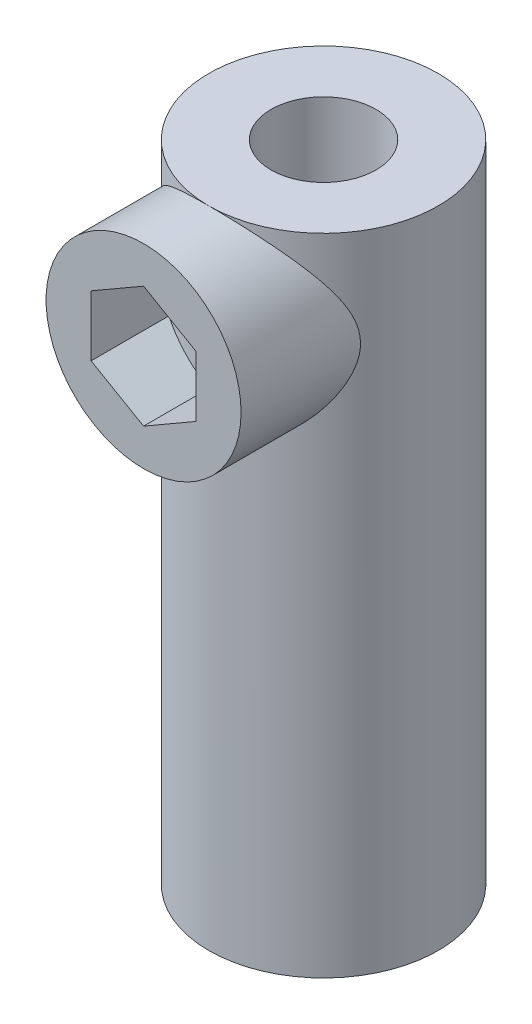
ISO-10303-21;
HEADER;
FILE_DESCRIPTION(('STEP AP214'),'2;1');
FILE_NAME('part.step','',(''),(''),'','','');
FILE_SCHEMA(('AUTOMOTIVE_DESIGN { 1 0 10303 214 1 1 1 1 }'));
ENDSEC;
DATA;
#1=APPLICATION_CONTEXT('core data for automotive mechanical design processes');
#2=APPLICATION_PROTOCOL_DEFINITION('international standard','automotive_design',2000,#1);
#3=PRODUCT_CONTEXT('',#1,'mechanical');
#4=PRODUCT('Part','Part','',(#3));
#5=PRODUCT_RELATED_PRODUCT_CATEGORY('part','',(#4));
#6=PRODUCT_DEFINITION_FORMATION('','',#4);
#7=PRODUCT_DEFINITION_CONTEXT('part definition',#1,'design');
#8=PRODUCT_DEFINITION('design','',#6,#7);
#9=PRODUCT_DEFINITION_SHAPE('','',#8);
#10=(LENGTH_UNIT() NAMED_UNIT(*) SI_UNIT(.MILLI.,.METRE.));
#11=(NAMED_UNIT(*) PLANE_ANGLE_UNIT() SI_UNIT($,.RADIAN.));
#12=(NAMED_UNIT(*) SI_UNIT($,.STERADIAN.) SOLID_ANGLE_UNIT());
#13=UNCERTAINTY_MEASURE_WITH_UNIT(LENGTH_MEASURE(1.E-05),#10,'distance_accuracy_value','');
#14=(GEOMETRIC_REPRESENTATION_CONTEXT(3) GLOBAL_UNCERTAINTY_ASSIGNED_CONTEXT((#13)) GLOBAL_UNIT_ASSIGNED_CONTEXT((#10,
#11,#12)) REPRESENTATION_CONTEXT('',''));
#15=CARTESIAN_POINT('',(0.,0.,0.));
#16=DIRECTION('',(0.,0.,1.));
#17=DIRECTION('',(1.,0.,0.));
#18=AXIS2_PLACEMENT_3D('',#15,#16,#17);
#19=CARTESIAN_POINT('',(0.,21.5,0.));
#20=DIRECTION('',(0.,1.,0.));
#21=DIRECTION('',(0.,0.,1.));
#22=AXIS2_PLACEMENT_3D('',#19,#20,#21);
#23=PLANE('',#22);
#24=CARTESIAN_POINT('',(0.,21.5,0.));
#25=DIRECTION('',(0.,1.,0.));
#26=DIRECTION('',(0.,0.,1.));
#27=AXIS2_PLACEMENT_3D('',#24,#25,#26);
#28=CIRCLE('',#27,7.65);
#29=CARTESIAN_POINT('',(0.,21.5,7.65));
#30=VERTEX_POINT('',#29);
#31=EDGE_CURVE('E12',#30,#30,#28,.T.);
#32=ORIENTED_EDGE('',*,*,#31,.T.);
#33=EDGE_LOOP('',(#32));
#34=FACE_BOUND('',#33,.T.);
#35=CARTESIAN_POINT('',(0.,21.5,0.));
#36=DIRECTION('',(0.,1.,0.));
#37=DIRECTION('',(0.,0.,1.));
#38=AXIS2_PLACEMENT_3D('',#35,#36,#37);
#39=CIRCLE('',#38,3.5);
#40=CARTESIAN_POINT('',(0.,21.5,3.5));
#41=VERTEX_POINT('',#40);
#42=EDGE_CURVE('E65',#41,#41,#39,.T.);
#43=ORIENTED_EDGE('',*,*,#42,.F.);
#44=EDGE_LOOP('',(#43));
#45=FACE_BOUND('',#44,.T.);
#46=ADVANCED_FACE('F57',(#34,#45),#23,.T.);
#47=CARTESIAN_POINT('',(0.,21.5,0.));
#48=DIRECTION('',(0.,-1.,0.));
#49=DIRECTION('',(0.,0.,-1.));
#50=AXIS2_PLACEMENT_3D('',#47,#48,#49);
#51=CYLINDRICAL_SURFACE('',#50,7.65);
#52=ORIENTED_EDGE('',*,*,#31,.F.);
#53=CARTESIAN_POINT('',(6.5,15.,4.03391869030599));
#54=CARTESIAN_POINT('',(6.49999880594593,15.1109920344448,4.03392206436329));
#55=CARTESIAN_POINT('',(6.49714842607336,15.2220209351757,4.03852481336712));
#56=CARTESIAN_POINT('',(6.48582565238759,15.4430986781032,4.05668266488845));
#57=CARTESIAN_POINT('',(6.47734937992992,15.5531467910348,4.07024394363137));
#58=CARTESIAN_POINT('',(6.4549713109572,15.7716481542604,4.10564020008858));
#59=CARTESIAN_POINT('',(6.44105436690729,15.8800960669002,4.12749827216898));
#60=CARTESIAN_POINT('',(6.40810839476618,16.0944966336692,4.17846442528634));
#61=CARTESIAN_POINT('',(6.38907723670139,16.2004482280857,4.20757552670421));
#62=CARTESIAN_POINT('',(6.33749525305287,16.4521444886909,4.2850445955481));
#63=CARTESIAN_POINT('',(6.30259661005797,16.5964828632677,4.33640887595706));
#64=CARTESIAN_POINT('',(6.22417163550574,16.8791577038976,4.44824122081794));
#65=CARTESIAN_POINT('',(6.18064052384551,17.0174907926485,4.5087143246664));
#66=CARTESIAN_POINT('',(6.08547050055896,17.2886119095082,4.63636743424818));
#67=CARTESIAN_POINT('',(6.03380970263124,17.4213837074085,4.70356536105675));
#68=CARTESIAN_POINT('',(5.92291703096014,17.6812318787089,4.84246448500782));
#69=CARTESIAN_POINT('',(5.86368563510034,17.8083086109191,4.91416539776036));
#70=CARTESIAN_POINT('',(5.70673092539118,18.1187697932968,5.09671478305162));
#71=CARTESIAN_POINT('',(5.60448368178362,18.298833076947,5.20934688579425));
#72=CARTESIAN_POINT('',(5.38406935724451,18.6475114366503,5.4368591122903));
#73=CARTESIAN_POINT('',(5.26589477975818,18.8161210652377,5.55174027271682));
#74=CARTESIAN_POINT('',(5.01385919921492,19.1416837946399,5.78036712807908));
#75=CARTESIAN_POINT('',(4.88001338648898,19.2986479463203,5.89411380847783));
#76=CARTESIAN_POINT('',(4.59652865814842,19.6005177952506,6.11776160228512));
#77=CARTESIAN_POINT('',(4.44689617047753,19.7454283577689,6.22766425680016));
#78=CARTESIAN_POINT('',(4.16635602558331,19.9918199877722,6.41763611238276));
#79=CARTESIAN_POINT('',(4.03853716438699,20.0958564832523,6.49896270773236));
#80=CARTESIAN_POINT('',(3.77331768369751,20.295241814654,6.65645153269014));
#81=CARTESIAN_POINT('',(3.63591932642952,20.3905926895243,6.73261497326889));
#82=CARTESIAN_POINT('',(3.35189092002638,20.5716382886225,6.87842863290172));
#83=CARTESIAN_POINT('',(3.20527253608082,20.657344846388,6.94808681562049));
#84=CARTESIAN_POINT('',(2.90305085087813,20.8182111491436,7.07968511745649));
#85=CARTESIAN_POINT('',(2.74744925921357,20.8933728916375,7.14162669807948));
#86=CARTESIAN_POINT('',(2.45644360679817,21.0196645914137,7.24622974345831));
#87=CARTESIAN_POINT('',(2.32238757403971,21.0726897579703,7.29035947294177));
#88=CARTESIAN_POINT('',(2.04921615581091,21.1702298624856,7.37180547065597));
#89=CARTESIAN_POINT('',(1.91010182966605,21.2147465702363,7.40912315574537));
#90=CARTESIAN_POINT('',(1.62755370785333,21.2946496307215,7.47627214661486));
#91=CARTESIAN_POINT('',(1.4841214255801,21.3300391417712,7.50610604193828));
#92=CARTESIAN_POINT('',(1.19377656686709,21.3911582209785,7.55772024297477));
#93=CARTESIAN_POINT('',(1.04686395111595,21.4168876799679,7.57950045767305));
#94=CARTESIAN_POINT('',(0.749923015342948,21.4583426890837,7.61462857465721));
#95=CARTESIAN_POINT('',(0.599883390545243,21.4740212035118,7.62793682846652));
#96=CARTESIAN_POINT('',(0.298549608851825,21.4948961817444,7.64566190089655));
#97=CARTESIAN_POINT('',(0.147255449292107,21.5000926232845,7.6500787006314));
#98=CARTESIAN_POINT('',(-0.155311817016419,21.4999048803707,7.64991917829146));
#99=CARTESIAN_POINT('',(-0.306584924488764,21.4945213511511,7.64534341314036));
#100=CARTESIAN_POINT('',(-0.60785023790395,21.4732775497288,7.62730561489838));
#101=CARTESIAN_POINT('',(-0.757842495917712,21.4574177054978,7.61384394480887));
#102=CARTESIAN_POINT('',(-1.04431381865001,21.4170670269415,7.57965323143254));
#103=CARTESIAN_POINT('',(-1.18096967487004,21.3933040362449,7.55953763139131));
#104=CARTESIAN_POINT('',(-1.45134616019478,21.337403460329,7.5123206935032));
#105=CARTESIAN_POINT('',(-1.58506579096477,21.305263073123,7.48521701838863));
#106=CARTESIAN_POINT('',(-1.98059070554117,21.1969207914691,7.39410397269428));
#107=CARTESIAN_POINT('',(-2.23699083312017,21.1087646109854,7.32026420049315));
#108=CARTESIAN_POINT('',(-2.75013119443144,20.8966129717109,7.14414283111815));
#109=CARTESIAN_POINT('',(-3.00528428624884,20.7703288832248,7.04006941518486));
#110=CARTESIAN_POINT('',(-3.49071349234056,20.4903111050015,6.81243984896068));
#111=CARTESIAN_POINT('',(-3.72096987925761,20.3365559001936,6.68886843698736));
#112=CARTESIAN_POINT('',(-4.10058791742225,20.0474669500013,6.46093244697219));
#113=CARTESIAN_POINT('',(-4.25572530398664,19.9172340950829,6.35955973472687));
#114=CARTESIAN_POINT('',(-4.55135087458483,19.6449523278251,6.15145178254238));
#115=CARTESIAN_POINT('',(-4.69183848166534,19.5029029505105,6.04471633164721));
#116=CARTESIAN_POINT('',(-4.95846999661617,19.2075245091846,5.8280064579781));
#117=CARTESIAN_POINT('',(-5.08458180492155,19.0541714146301,5.71802545134806));
#118=CARTESIAN_POINT('',(-5.32212542557276,18.7368775919579,5.49760848788709));
#119=CARTESIAN_POINT('',(-5.43356196815208,18.5729403009274,5.38717268954241));
#120=CARTESIAN_POINT('',(-5.61775617028429,18.2732599471518,5.19392174872709));
#121=CARTESIAN_POINT('',(-5.69351902890342,18.1396892729234,5.11058843960901));
#122=CARTESIAN_POINT('',(-5.8361178611338,17.865930860576,4.94711871399189));
#123=CARTESIAN_POINT('',(-5.90295272420427,17.7257423021973,4.86698269606724));
#124=CARTESIAN_POINT('',(-6.02718102778423,17.4387430413213,4.71226094527958));
#125=CARTESIAN_POINT('',(-6.08459704872671,17.2919492844158,4.63766218006163));
#126=CARTESIAN_POINT('',(-6.18955181468858,16.9911885441309,4.49662869062074));
#127=CARTESIAN_POINT('',(-6.23709642761751,16.8372258892231,4.43018912593583));
#128=CARTESIAN_POINT('',(-6.33197781723695,16.4824090487558,4.29384175085593));
#129=CARTESIAN_POINT('',(-6.37632358202969,16.2794140583566,4.2271790617023));
#130=CARTESIAN_POINT('',(-6.42843242994652,15.9676558942498,4.1471405047364));
#131=CARTESIAN_POINT('',(-6.4433950901937,15.8625999347277,4.12379606473809));
#132=CARTESIAN_POINT('',(-6.46824661375492,15.6505122640737,4.08470614481104));
#133=CARTESIAN_POINT('',(-6.47813807989229,15.5434815957577,4.06895676691426));
#134=CARTESIAN_POINT('',(-6.49267942496226,15.3270896915143,4.04571472064999));
#135=CARTESIAN_POINT('',(-6.49727668366078,15.21771588262,4.03830495761726));
#136=CARTESIAN_POINT('',(-6.50092287240017,14.9986363788047,4.03243282353423));
#137=CARTESIAN_POINT('',(-6.49997206690647,14.8889306999526,4.03397002599947));
#138=CARTESIAN_POINT('',(-6.49254753293766,14.670122074708,4.04590834222984));
#139=CARTESIAN_POINT('',(-6.48606996920922,14.5610195998333,4.05631561130719));
#140=CARTESIAN_POINT('',(-6.46776243251989,14.3443452464627,4.08544256087898));
#141=CARTESIAN_POINT('',(-6.45592942415457,14.2367742717169,4.10416695531258));
#142=CARTESIAN_POINT('',(-6.42427944427686,14.0023477349408,4.15357171888214));
#143=CARTESIAN_POINT('',(-6.4033313855027,13.8759947978621,4.18590475560627));
#144=CARTESIAN_POINT('',(-6.35464305992029,13.6271896129384,4.25945420952066));
#145=CARTESIAN_POINT('',(-6.32689714968014,13.5047407020779,4.30067800420741));
#146=CARTESIAN_POINT('',(-6.26506066608151,13.2637583303593,4.39027121693087));
#147=CARTESIAN_POINT('',(-6.23095257547014,13.1452367702567,4.43866028569342));
#148=CARTESIAN_POINT('',(-6.15688795196014,12.912504096951,4.54083898071107));
#149=CARTESIAN_POINT('',(-6.11693286765406,12.7982919248874,4.5946272682762));
#150=CARTESIAN_POINT('',(-6.00401614571994,12.5018597578462,4.74210665104851));
#151=CARTESIAN_POINT('',(-5.92634877535979,12.323123448683,4.83921957799867));
#152=CARTESIAN_POINT('',(-5.75696947089943,11.9759928683752,5.03954931341251));
#153=CARTESIAN_POINT('',(-5.66524910394108,11.8076048925872,5.14276976386983));
#154=CARTESIAN_POINT('',(-5.46806062569114,11.4805090466486,5.35196293949988));
#155=CARTESIAN_POINT('',(-5.36257462577955,11.3218141737408,5.45793909971734));
#156=CARTESIAN_POINT('',(-5.13810425835426,11.0142610499114,5.66976250363845));
#157=CARTESIAN_POINT('',(-5.01912283403454,10.8654006653667,5.77560977038223));
#158=CARTESIAN_POINT('',(-4.76235974937839,10.5717340556492,5.98928060218708));
#159=CARTESIAN_POINT('',(-4.62400034629445,10.4273569830968,6.09700200505508));
#160=CARTESIAN_POINT('',(-4.33249250851092,10.1502635011377,6.30748249642632));
#161=CARTESIAN_POINT('',(-4.1793412560165,10.0175493227038,6.4102406338302));
#162=CARTESIAN_POINT('',(-3.85873659195709,9.7653422411547,6.6081811107188));
#163=CARTESIAN_POINT('',(-3.69132123092806,9.64581600131302,6.70338237315135));
#164=CARTESIAN_POINT('',(-3.34220051807833,9.42122594263303,6.88409612179609));
#165=CARTESIAN_POINT('',(-3.16050277923136,9.31615449996439,6.9696137111826));
#166=CARTESIAN_POINT('',(-2.84308154830063,9.15295510786452,7.10344994133551));
#167=CARTESIAN_POINT('',(-2.71093542275595,9.09047419763023,7.15499338360002));
#168=CARTESIAN_POINT('',(-2.44074263024306,8.97385601617805,7.25160972906593));
#169=CARTESIAN_POINT('',(-2.30269756163638,8.91971650288043,7.29668437078884));
#170=CARTESIAN_POINT('',(-2.02134276661352,8.82048434505497,7.3795779342381));
#171=CARTESIAN_POINT('',(-1.87803551837696,8.77538750499752,7.41740022048237));
#172=CARTESIAN_POINT('',(-1.58687430359225,8.69487187815499,7.4850962121786));
#173=CARTESIAN_POINT('',(-1.43902021344534,8.65945335471893,7.51496970134154));
#174=CARTESIAN_POINT('',(-1.13881006173787,8.59869466244425,7.56630318718154));
#175=CARTESIAN_POINT('',(-0.98643151437395,8.57341935995469,7.58770902077639));
#176=CARTESIAN_POINT('',(-0.679256285460866,8.53373440061767,7.62135025826956));
#177=CARTESIAN_POINT('',(-0.524459608852426,8.5193247215725,7.63358568090239));
#178=CARTESIAN_POINT('',(-0.213811465691639,8.50165544532272,7.64859203795745));
#179=CARTESIAN_POINT('',(-0.0579602805985562,8.49839298198529,7.65136540522973));
#180=CARTESIAN_POINT('',(0.253444297227133,8.50307687034979,7.64738572026388));
#181=CARTESIAN_POINT('',(0.408997709830555,8.51102244601567,7.64063332758209));
#182=CARTESIAN_POINT('',(0.703624167685331,8.53666920427617,7.61886505426041));
#183=CARTESIAN_POINT('',(0.842850035804685,8.5533642485636,7.60470162542553));
#184=CARTESIAN_POINT('',(1.11905010488053,8.5955288792327,7.56899099835182));
#185=CARTESIAN_POINT('',(1.25602354145916,8.62100138244866,7.54744134561218));
#186=CARTESIAN_POINT('',(1.52679814871642,8.68034107254459,7.49735521156584));
#187=CARTESIAN_POINT('',(1.66060007563338,8.71420623569832,7.46882041461068));
#188=CARTESIAN_POINT('',(1.92437819068201,8.78987719726003,7.40524866057372));
#189=CARTESIAN_POINT('',(2.05435291093468,8.83168599769344,7.37020924540974));
#190=CARTESIAN_POINT('',(2.44899712795801,8.97235127499649,7.25274297031769));
#191=CARTESIAN_POINT('',(2.70633623670193,9.08377978027282,7.16024045860175));
#192=CARTESIAN_POINT('',(3.19795402038539,9.33436558956235,6.95462251109653));
#193=CARTESIAN_POINT('',(3.43222696298682,9.47352976050835,6.84150197118824));
#194=CARTESIAN_POINT('',(3.81882160481222,9.73633070436521,6.63130592821667));
#195=CARTESIAN_POINT('',(3.97667233503544,9.85468100917231,6.53764253249543));
#196=CARTESIAN_POINT('',(4.27877349744841,10.1030277130126,6.34403492452483));
#197=CARTESIAN_POINT('',(4.42302316993484,10.2330247617986,6.24409036195241));
#198=CARTESIAN_POINT('',(4.69844481893354,10.5042098608611,6.03959077302246));
#199=CARTESIAN_POINT('',(4.82956088871055,10.6454415119465,5.93501856017163));
#200=CARTESIAN_POINT('',(5.07808203704409,10.9379907995374,5.7238240780029));
#201=CARTESIAN_POINT('',(5.19548963159488,11.0893065772128,5.6172021890706));
#202=CARTESIAN_POINT('',(5.41880696393431,11.4049141597429,5.40217694152123));
#203=CARTESIAN_POINT('',(5.52444478824379,11.5694027989991,5.29377984298842));
#204=CARTESIAN_POINT('',(5.72137979489928,11.9089847096171,5.08029503074103));
#205=CARTESIAN_POINT('',(5.81266861388655,12.0840840837115,4.9752092753689));
#206=CARTESIAN_POINT('',(5.97992465805256,12.4446505418315,4.77285434829495));
#207=CARTESIAN_POINT('',(6.05595855420705,12.6300677773935,4.67555233262382));
#208=CARTESIAN_POINT('',(6.19200478148856,13.0124795136901,4.49382028599753));
#209=CARTESIAN_POINT('',(6.25204141511349,13.2094558921702,4.40937081457016));
#210=CARTESIAN_POINT('',(6.35399651412186,13.6144124831391,4.26114284479617));
#211=CARTESIAN_POINT('',(6.39603292138782,13.822310721995,4.19723049372819));
#212=CARTESIAN_POINT('',(6.44388917461408,14.141033992921,4.12306304384576));
#213=CARTESIAN_POINT('',(6.45729938575781,14.2482545638711,4.10197291432659));
#214=CARTESIAN_POINT('',(6.47881090154284,14.4644806323762,4.06791390524695));
#215=CARTESIAN_POINT('',(6.48691592307626,14.5734848253001,4.05493934008891));
#216=CARTESIAN_POINT('',(6.49483629824181,14.7356294492139,4.04222967979317));
#217=CARTESIAN_POINT('',(6.49677086439516,14.7884263283081,4.03911804577798));
#218=CARTESIAN_POINT('',(6.4993531604053,14.8941459914203,4.03496148887312));
#219=CARTESIAN_POINT('',(6.50000056943465,14.9470688035372,4.03391708124557));
#220=CARTESIAN_POINT('',(6.5,15.,4.03391869030599));
#221=B_SPLINE_CURVE_WITH_KNOTS('',3,(#53,#54,#55,#56,#57,#58,#59,#60,#61,#62,#63,#64,#65,#66,
#67,#68,#69,#70,#71,#72,#73,#74,#75,#76,#77,#78,#79,#80,#81,#82,#83,#84,#85,#86,#87,#88,#89,#90,
#91,#92,#93,#94,#95,#96,#97,#98,#99,#100,#101,#102,#103,#104,#105,#106,#107,#108,#109,#110,#111,
#112,#113,#114,#115,#116,#117,#118,#119,#120,#121,#122,#123,#124,#125,#126,#127,#128,#129,#130,
#131,#132,#133,#134,#135,#136,#137,#138,#139,#140,#141,#142,#143,#144,#145,#146,#147,#148,#149,
#150,#151,#152,#153,#154,#155,#156,#157,#158,#159,#160,#161,#162,#163,#164,#165,#166,#167,#168,
#169,#170,#171,#172,#173,#174,#175,#176,#177,#178,#179,#180,#181,#182,#183,#184,#185,#186,#187,
#188,#189,#190,#191,#192,#193,#194,#195,#196,#197,#198,#199,#200,#201,#202,#203,#204,#205,#206,
#207,#208,#209,#210,#211,#212,#213,#214,#215,#216,#217,#218,#219,#220),.UNSPECIFIED.,.T.,.F.,(4,
2,2,2,2,2,2,2,2,2,2,2,2,2,2,2,2,2,2,2,2,2,2,2,2,2,2,2,2,2,2,2,2,2,2,2,2,2,2,2,2,2,2,2,2,2,2,2,2,
2,2,2,2,2,2,2,2,2,2,2,2,2,2,2,2,2,2,2,2,2,2,2,2,2,2,2,2,2,2,2,2,2,2,4),(0.,0.332911845765214,
0.666053448816027,1.00012924344893,1.33434439055966,1.80495324949592,2.27582343252953,
2.74798366485205,3.22011410741517,3.92633244990351,4.63288435822182,5.33875697981566,
6.04434328873043,6.5952102800792,7.14594762039564,7.69600166508286,8.24595137196878,
8.6978055590125,9.14956565612102,9.6011692187588,10.0527778848206,10.5064848199484,
10.9601927187698,11.4138725196319,11.8675337882011,12.2875290306479,12.7076649295144,
13.5472457649905,14.4534416343169,15.3603503622474,16.0390403724845,16.7177571015316,
17.3979608132667,18.0779447375748,18.6017518167043,19.125623990908,19.6482212921754,
20.1705070482949,20.8226548016606,21.1482832913981,21.4737444824575,21.8024133164253,
22.1310664835164,22.4599479027263,22.7890159620391,23.1846751689565,23.5806639634028,
23.9777595894722,24.3747570011468,25.0269825049283,25.6796009372779,26.3330760621732,
26.9864089448315,27.6670350590222,28.3477910867656,29.0267848317322,29.7054190736658,
30.1699837144056,30.6344232663899,31.0986468311667,31.5628830263064,32.0300424518128,
32.4972009229426,32.9642392708909,33.4312452830488,33.8535688734132,34.2760329415403,
34.6983952396462,35.1209174737389,36.0032052441335,36.8857117276527,37.5400740581685,
38.1944729172484,38.8515485401015,39.5085033759359,40.1783937426681,40.8486731205512,
41.5159560037786,42.1822193180942,42.8440477099658,43.1739703540896,43.5036616015455,
43.662384989741,43.8211479352184),.UNSPECIFIED.);
#222=EDGE_CURVE('E118',#30,#30,#221,.T.);
#223=ORIENTED_EDGE('',*,*,#222,.F.);
#224=EDGE_LOOP('',(#52,#223));
#225=FACE_BOUND('',#224,.T.);
#226=CARTESIAN_POINT('',(0.,-21.5,0.));
#227=DIRECTION('',(0.,1.,0.));
#228=DIRECTION('',(0.,0.,1.));
#229=AXIS2_PLACEMENT_3D('',#226,#227,#228);
#230=CIRCLE('',#229,7.65);
#231=CARTESIAN_POINT('',(0.,-21.5,7.65));
#232=VERTEX_POINT('',#231);
#233=EDGE_CURVE('E156',#232,#232,#230,.T.);
#234=ORIENTED_EDGE('',*,*,#233,.T.);
#235=EDGE_LOOP('',(#234));
#236=FACE_BOUND('',#235,.T.);
#237=ADVANCED_FACE('F59',(#225,#236),#51,.T.);
#238=CARTESIAN_POINT('',(0.,21.5,0.));
#239=DIRECTION('',(0.,-1.,0.));
#240=DIRECTION('',(0.,0.,-1.));
#241=AXIS2_PLACEMENT_3D('',#238,#239,#240);
#242=CYLINDRICAL_SURFACE('',#241,3.5);
#243=CARTESIAN_POINT('',(2.25,15.,2.6809513236909));
#244=CARTESIAN_POINT('',(2.24998993279656,15.1110278510981,2.68096794230369));
#245=CARTESIAN_POINT('',(2.24171080111607,15.2221418110205,2.68797562628284));
#246=CARTESIAN_POINT('',(2.20923372044863,15.4404991821665,2.71471747257956));
#247=CARTESIAN_POINT('',(2.18500551900026,15.5477348283372,2.73447581916208));
#248=CARTESIAN_POINT('',(2.12243449318278,15.7545559296924,2.78331005782398));
#249=CARTESIAN_POINT('',(2.08421758685385,15.854200336079,2.81230253633535));
#250=CARTESIAN_POINT('',(1.99512179454972,16.0455339130931,2.8761937684625));
#251=CARTESIAN_POINT('',(1.94424018628447,16.1372213676439,2.91109379139403));
#252=CARTESIAN_POINT('',(1.82279355712549,16.3244200508419,2.98886782180925));
#253=CARTESIAN_POINT('',(1.75045432357929,16.4186033254313,3.0321684531223));
#254=CARTESIAN_POINT('',(1.59176125293289,16.5946333162801,3.11840835651351));
#255=CARTESIAN_POINT('',(1.50539505343587,16.6764690263946,3.16134727436577));
#256=CARTESIAN_POINT('',(1.3074746383366,16.8360801127766,3.2486397721681));
#257=CARTESIAN_POINT('',(1.19410442216513,16.911933825449,3.29244743403364));
#258=CARTESIAN_POINT('',(0.952887059290315,17.0428642291422,3.37016674077314));
#259=CARTESIAN_POINT('',(0.825055135037433,17.0979625076338,3.40408865932495));
#260=CARTESIAN_POINT('',(0.572700118508682,17.1794798067673,3.4549565291279));
#261=CARTESIAN_POINT('',(0.449266135237107,17.2083222602879,3.47332223431809));
#262=CARTESIAN_POINT('',(0.26106150028913,17.2357079983162,3.49082401452886));
#263=CARTESIAN_POINT('',(0.197811650016832,17.2421901180905,3.49498339775228));
#264=CARTESIAN_POINT('',(0.0708620491218975,17.2497821039921,3.49985859075535));
#265=CARTESIAN_POINT('',(0.00716235602789695,17.2508926450417,3.50057483315489));
#266=CARTESIAN_POINT('',(-0.165568191684278,17.2465456524078,3.49777776510425));
#267=CARTESIAN_POINT('',(-0.274469874427636,17.2358284758202,3.49087691185325));
#268=CARTESIAN_POINT('',(-0.488485570650298,17.1990220282097,3.46742022137514));
#269=CARTESIAN_POINT('',(-0.593599299939493,17.1729316063508,3.45086366132603));
#270=CARTESIAN_POINT('',(-0.797514374385264,17.1066481329344,3.4095155369999));
#271=CARTESIAN_POINT('',(-0.896316029506293,17.0664557745051,3.38472437746719));
#272=CARTESIAN_POINT('',(-1.08581075230308,16.9734914314954,3.32878241324653));
#273=CARTESIAN_POINT('',(-1.17650213765581,16.920716845253,3.2976302934767));
#274=CARTESIAN_POINT('',(-1.35963805843268,16.7965630687174,3.22679537049769));
#275=CARTESIAN_POINT('',(-1.45082867226407,16.7236689521756,3.18653123612724));
#276=CARTESIAN_POINT('',(-1.62048254862862,16.5652590565266,3.10370305689108));
#277=CARTESIAN_POINT('',(-1.69892627690037,16.4797242818839,3.06113561287145));
#278=CARTESIAN_POINT('',(-1.85216127593062,16.2843396062235,2.97126930905273));
#279=CARTESIAN_POINT('',(-1.92487286981337,16.1727617539059,2.9241510543335));
#280=CARTESIAN_POINT('',(-2.05032728211498,15.9362152473532,2.8376007355141));
#281=CARTESIAN_POINT('',(-2.10310602558655,15.8112712098565,2.79815490622919));
#282=CARTESIAN_POINT('',(-2.17459264754253,15.586116144777,2.74273753666387));
#283=CARTESIAN_POINT('',(-2.19866894824572,15.4884701247727,2.7232971442787));
#284=CARTESIAN_POINT('',(-2.23358563071415,15.2894241104593,2.69473933554445));
#285=CARTESIAN_POINT('',(-2.24444614072375,15.1880300678831,2.68560622228873));
#286=CARTESIAN_POINT('',(-2.25226446658786,14.9839983959535,2.67905534721847));
#287=CARTESIAN_POINT('',(-2.24917944170268,14.8813579018803,2.68167368573533));
#288=CARTESIAN_POINT('',(-2.22922734825303,14.6783323772377,2.69827729926398));
#289=CARTESIAN_POINT('',(-2.21234874306908,14.5779493069636,2.71227208921492));
#290=CARTESIAN_POINT('',(-2.16651453733593,14.3849566591738,2.74900598607657));
#291=CARTESIAN_POINT('',(-2.1379269826748,14.2922055396829,2.77147708985218));
#292=CARTESIAN_POINT('',(-2.0698698076764,14.1126624345131,2.82266682944014));
#293=CARTESIAN_POINT('',(-2.03039658628929,14.0258724326989,2.8513875319963));
#294=CARTESIAN_POINT('',(-1.9328244593948,13.8426438859404,2.9186200084255));
#295=CARTESIAN_POINT('',(-1.87259211174995,13.7476422774685,2.95794786199254));
#296=CARTESIAN_POINT('',(-1.73909343121181,13.5680090916421,3.03836163358643));
#297=CARTESIAN_POINT('',(-1.66581151559641,13.4833901187049,3.07944960835945));
#298=CARTESIAN_POINT('',(-1.49241702530615,13.3109871239774,3.16761844530397));
#299=CARTESIAN_POINT('',(-1.38984870575326,13.2254964068915,3.21440739400657));
#300=CARTESIAN_POINT('',(-1.16921660965138,13.0729924393256,3.30104998048744));
#301=CARTESIAN_POINT('',(-1.05116972150859,13.0059592937029,3.34091106847026));
#302=CARTESIAN_POINT('',(-0.827053794223495,12.9046620404733,3.4024510445066));
#303=CARTESIAN_POINT('',(-0.723294442946526,12.8665282789409,3.42617086324433));
#304=CARTESIAN_POINT('',(-0.509731929508921,12.8056956172991,3.46437672125789));
#305=CARTESIAN_POINT('',(-0.399933736735498,12.782984225559,3.47887023295334));
#306=CARTESIAN_POINT('',(-0.176900565596905,12.7541397622241,3.49732230223902));
#307=CARTESIAN_POINT('',(-0.0636552296509966,12.748062957644,3.50124510337195));
#308=CARTESIAN_POINT('',(0.162310335776909,12.7530185978975,3.49805965995272));
#309=CARTESIAN_POINT('',(0.275030533888278,12.7640520520435,3.49095076465477));
#310=CARTESIAN_POINT('',(0.490433557665958,12.8015258228908,3.46707325987076));
#311=CARTESIAN_POINT('',(0.593330075105532,12.8271048629793,3.45084520306644));
#312=CARTESIAN_POINT('',(0.793100276286804,12.8917958758713,3.41048199247624));
#313=CARTESIAN_POINT('',(0.88997298724147,12.9309100278049,3.38634556548954));
#314=CARTESIAN_POINT('',(1.08287498679204,13.024596145791,3.32989763999537));
#315=CARTESIAN_POINT('',(1.17831102430336,13.0800980320532,3.29711324727645));
#316=CARTESIAN_POINT('',(1.35896650831368,13.2034220813364,3.22685967945501));
#317=CARTESIAN_POINT('',(1.44417800816336,13.2712537255581,3.18938690609357));
#318=CARTESIAN_POINT('',(1.61572260847502,13.429157375361,3.10642041927923));
#319=CARTESIAN_POINT('',(1.70021898080631,13.5210450734011,3.06057859011959));
#320=CARTESIAN_POINT('',(1.85326379245017,13.7180202695562,2.97040476096267));
#321=CARTESIAN_POINT('',(1.92180641723402,13.8231125588173,2.92607331645183));
#322=CARTESIAN_POINT('',(2.03325398122752,14.0303123593355,2.84952970082758));
#323=CARTESIAN_POINT('',(2.07836690781949,14.1309213290343,2.81648946329075));
#324=CARTESIAN_POINT('',(2.15380817755849,14.3397996394599,2.75923416036607));
#325=CARTESIAN_POINT('',(2.18417398653391,14.4480487591835,2.73499677084659));
#326=CARTESIAN_POINT('',(2.22073361962975,14.6308919548486,2.70530605301007));
#327=CARTESIAN_POINT('',(2.23166990230549,14.7039745185406,2.69624609230348));
#328=CARTESIAN_POINT('',(2.24630634998145,14.8513585456327,2.6840632566126));
#329=CARTESIAN_POINT('',(2.25000674061678,14.9256599709525,2.68094019649943));
#330=CARTESIAN_POINT('',(2.25,15.,2.6809513236909));
#331=B_SPLINE_CURVE_WITH_KNOTS('',3,(#243,#244,#245,#246,#247,#248,#249,#250,#251,#252,#253,
#254,#255,#256,#257,#258,#259,#260,#261,#262,#263,#264,#265,#266,#267,#268,#269,#270,#271,#272,
#273,#274,#275,#276,#277,#278,#279,#280,#281,#282,#283,#284,#285,#286,#287,#288,#289,#290,#291,
#292,#293,#294,#295,#296,#297,#298,#299,#300,#301,#302,#303,#304,#305,#306,#307,#308,#309,#310,
#311,#312,#313,#314,#315,#316,#317,#318,#319,#320,#321,#322,#323,#324,#325,#326,#327,#328,#329,
#330),.UNSPECIFIED.,.T.,.F.,(4,2,2,2,2,2,2,2,2,2,2,2,2,2,2,2,2,2,2,2,2,2,2,2,2,2,2,2,2,2,2,2,2,
2,2,2,2,2,2,2,2,2,2,4),(0.,0.332747405290111,0.666127797128148,0.996578267475526,
1.32709982990864,1.70488357037008,2.08300208827668,2.51043691367016,2.93742593377158,
3.31909089208858,3.50995890153378,3.7008029283838,4.02800058752422,4.35522274368344,
4.68242881870657,5.00970260980392,5.37875195797702,5.74836163684474,6.17015995527988,
6.59119439537438,6.89723644188507,7.20281178682076,7.5093264973106,7.81609783203559,
8.11388781485575,8.41177642696695,8.76797690724211,9.12460562052131,9.5469917124931,
9.9689207224482,10.3066632064346,10.6441318023679,10.9827404941252,11.3213691607396,
11.6417703868448,11.9622232210183,12.3063972236073,12.6508370136301,13.0481637048372,
13.4456349804135,13.7896644753437,14.132815312559,14.3556172754663,14.5784122906818),.UNSPECIFIED.);
#332=CARTESIAN_POINT('',(2.25,15.,2.6809513236909));
#333=VERTEX_POINT('',#332);
#334=EDGE_CURVE('E196',#333,#333,#331,.T.);
#335=ORIENTED_EDGE('',*,*,#334,.T.);
#336=EDGE_LOOP('',(#335));
#337=FACE_BOUND('',#336,.T.);
#338=ORIENTED_EDGE('',*,*,#42,.T.);
#339=EDGE_LOOP('',(#338));
#340=FACE_BOUND('',#339,.T.);
#341=CARTESIAN_POINT('',(0.,-21.5,0.));
#342=DIRECTION('',(0.,1.,0.));
#343=DIRECTION('',(0.,0.,1.));
#344=AXIS2_PLACEMENT_3D('',#341,#342,#343);
#345=CIRCLE('',#344,3.5);
#346=CARTESIAN_POINT('',(0.,-21.5,3.5));
#347=VERTEX_POINT('',#346);
#348=EDGE_CURVE('E153',#347,#347,#345,.T.);
#349=ORIENTED_EDGE('',*,*,#348,.F.);
#350=EDGE_LOOP('',(#349));
#351=FACE_BOUND('',#350,.T.);
#352=ADVANCED_FACE('F162',(#337,#340,#351),#242,.F.);
#353=CARTESIAN_POINT('',(0.,-21.5,0.));
#354=DIRECTION('',(0.,-1.,0.));
#355=DIRECTION('',(0.,0.,1.));
#356=AXIS2_PLACEMENT_3D('',#353,#354,#355);
#357=PLANE('',#356);
#358=ORIENTED_EDGE('',*,*,#233,.F.);
#359=EDGE_LOOP('',(#358));
#360=FACE_BOUND('',#359,.T.);
#361=ORIENTED_EDGE('',*,*,#348,.T.);
#362=EDGE_LOOP('',(#361));
#363=FACE_BOUND('',#362,.T.);
#364=ADVANCED_FACE('F174',(#360,#363),#357,.T.);
#365=CARTESIAN_POINT('',(-3.5,17.0207259421637,-500000.));
#366=DIRECTION('',(-1.,0.,0.));
#367=DIRECTION('',(0.,0.,1.));
#368=AXIS2_PLACEMENT_3D('',#365,#366,#367);
#369=PLANE('',#368);
#370=DIRECTION('',(0.,-1.,0.));
#371=VECTOR('',#370,1.);
#372=CARTESIAN_POINT('',(-3.5,21.5,6.80238928612587));
#373=LINE('',#372,#371);
#374=CARTESIAN_POINT('',(-3.50000000000125,17.020725942163,6.80238928612522));
#375=VERTEX_POINT('',#374);
#376=CARTESIAN_POINT('',(-3.50000000000125,12.979274057837,6.80238928612522));
#377=VERTEX_POINT('',#376);
#378=EDGE_CURVE('E114',#375,#377,#373,.T.);
#379=ORIENTED_EDGE('',*,*,#378,.F.);
#380=DIRECTION('',(0.,0.,1.));
#381=VECTOR('',#380,1.);
#382=CARTESIAN_POINT('',(-3.5,17.0207259421637,-500000.));
#383=LINE('',#382,#381);
#384=CARTESIAN_POINT('',(-3.5,17.0207259421637,12.));
#385=VERTEX_POINT('',#384);
#386=EDGE_CURVE('E145',#375,#385,#383,.T.);
#387=ORIENTED_EDGE('',*,*,#386,.T.);
#388=DIRECTION('',(0.,-1.,0.));
#389=VECTOR('',#388,1.);
#390=CARTESIAN_POINT('',(-3.5,17.0207259421637,12.));
#391=LINE('',#390,#389);
#392=CARTESIAN_POINT('',(-3.5,12.9792740578363,12.));
#393=VERTEX_POINT('',#392);
#394=EDGE_CURVE('E239',#385,#393,#391,.T.);
#395=ORIENTED_EDGE('',*,*,#394,.T.);
#396=DIRECTION('',(0.,0.,1.));
#397=VECTOR('',#396,1.);
#398=CARTESIAN_POINT('',(-3.5,12.9792740578363,-500000.));
#399=LINE('',#398,#397);
#400=EDGE_CURVE('E147',#377,#393,#399,.T.);
#401=ORIENTED_EDGE('',*,*,#400,.F.);
#402=EDGE_LOOP('',(#379,#387,#395,#401));
#403=FACE_BOUND('',#402,.T.);
#404=ADVANCED_FACE('F178',(#403),#369,.F.);
#405=CARTESIAN_POINT('',(0.,19.0414518843274,-500000.));
#406=DIRECTION('',(-0.500000000000001,0.866025403784438,0.));
#407=DIRECTION('',(-0.866025403784438,-0.500000000000001,0.));
#408=AXIS2_PLACEMENT_3D('',#405,#406,#407);
#409=PLANE('',#408);
#410=CARTESIAN_POINT('',(0.,19.0414518843274,0.));
#411=DIRECTION('',(-0.500000000000001,0.866025403784438,0.));
#412=DIRECTION('',(-0.866025403784438,-0.500000000000001,0.));
#413=AXIS2_PLACEMENT_3D('',#410,#411,#412);
#414=ELLIPSE('',#413,8.83345911860128,7.65);
#415=CARTESIAN_POINT('',(0.,19.0414518843274,7.65));
#416=VERTEX_POINT('',#415);
#417=EDGE_CURVE('E72',#416,#375,#414,.F.);
#418=ORIENTED_EDGE('',*,*,#417,.F.);
#419=DIRECTION('',(0.,0.,1.));
#420=VECTOR('',#419,1.);
#421=CARTESIAN_POINT('',(0.,19.0414518843274,-500000.));
#422=LINE('',#421,#420);
#423=CARTESIAN_POINT('',(0.,19.0414518843274,12.));
#424=VERTEX_POINT('',#423);
#425=EDGE_CURVE('E143',#416,#424,#422,.T.);
#426=ORIENTED_EDGE('',*,*,#425,.T.);
#427=DIRECTION('',(-0.866025403784438,-0.500000000000001,0.));
#428=VECTOR('',#427,1.);
#429=CARTESIAN_POINT('',(0.,19.0414518843274,12.));
#430=LINE('',#429,#428);
#431=EDGE_CURVE('E237',#424,#385,#430,.T.);
#432=ORIENTED_EDGE('',*,*,#431,.T.);
#433=ORIENTED_EDGE('',*,*,#386,.F.);
#434=EDGE_LOOP('',(#418,#426,#432,#433));
#435=FACE_BOUND('',#434,.T.);
#436=ADVANCED_FACE('F212',(#435),#409,.F.);
#437=CARTESIAN_POINT('',(3.5,17.0207259421637,-500000.));
#438=DIRECTION('',(0.5,0.866025403784439,0.));
#439=DIRECTION('',(-0.866025403784439,0.5,0.));
#440=AXIS2_PLACEMENT_3D('',#437,#438,#439);
#441=PLANE('',#440);
#442=CARTESIAN_POINT('',(0.,19.0414518843274,0.));
#443=DIRECTION('',(0.5,0.866025403784439,0.));
#444=DIRECTION('',(0.866025403784439,-0.5,0.));
#445=AXIS2_PLACEMENT_3D('',#442,#443,#444);
#446=ELLIPSE('',#445,8.83345911860127,7.65);
#447=CARTESIAN_POINT('',(3.5,17.0207259421637,6.80238928612587));
#448=VERTEX_POINT('',#447);
#449=EDGE_CURVE('E77',#448,#416,#446,.F.);
#450=ORIENTED_EDGE('',*,*,#449,.F.);
#451=DIRECTION('',(0.,0.,1.));
#452=VECTOR('',#451,1.);
#453=CARTESIAN_POINT('',(3.5,17.0207259421637,-500000.));
#454=LINE('',#453,#452);
#455=CARTESIAN_POINT('',(3.5,17.0207259421637,12.));
#456=VERTEX_POINT('',#455);
#457=EDGE_CURVE('E137',#448,#456,#454,.T.);
#458=ORIENTED_EDGE('',*,*,#457,.T.);
#459=DIRECTION('',(-0.866025403784439,0.5,0.));
#460=VECTOR('',#459,1.);
#461=CARTESIAN_POINT('',(3.5,17.0207259421637,12.));
#462=LINE('',#461,#460);
#463=EDGE_CURVE('E232',#456,#424,#462,.T.);
#464=ORIENTED_EDGE('',*,*,#463,.T.);
#465=ORIENTED_EDGE('',*,*,#425,.F.);
#466=EDGE_LOOP('',(#450,#458,#464,#465));
#467=FACE_BOUND('',#466,.T.);
#468=ADVANCED_FACE('F215',(#467),#441,.F.);
#469=CARTESIAN_POINT('',(3.5,12.9792740578363,-500000.));
#470=DIRECTION('',(1.,0.,0.));
#471=DIRECTION('',(0.,1.,0.));
#472=AXIS2_PLACEMENT_3D('',#469,#470,#471);
#473=PLANE('',#472);
#474=DIRECTION('',(0.,-1.,0.));
#475=VECTOR('',#474,1.);
#476=CARTESIAN_POINT('',(3.5,21.5,6.80238928612587));
#477=LINE('',#476,#475);
#478=CARTESIAN_POINT('',(3.50000000000126,12.979274057837,6.80238928612522));
#479=VERTEX_POINT('',#478);
#480=EDGE_CURVE('E127',#479,#448,#477,.F.);
#481=ORIENTED_EDGE('',*,*,#480,.F.);
#482=DIRECTION('',(0.,0.,1.));
#483=VECTOR('',#482,1.);
#484=CARTESIAN_POINT('',(3.5,12.9792740578363,-500000.));
#485=LINE('',#484,#483);
#486=CARTESIAN_POINT('',(3.5,12.9792740578363,12.));
#487=VERTEX_POINT('',#486);
#488=EDGE_CURVE('E126',#479,#487,#485,.T.);
#489=ORIENTED_EDGE('',*,*,#488,.T.);
#490=DIRECTION('',(0.,1.,0.));
#491=VECTOR('',#490,1.);
#492=CARTESIAN_POINT('',(3.5,12.9792740578363,12.));
#493=LINE('',#492,#491);
#494=EDGE_CURVE('E230',#487,#456,#493,.T.);
#495=ORIENTED_EDGE('',*,*,#494,.T.);
#496=ORIENTED_EDGE('',*,*,#457,.F.);
#497=EDGE_LOOP('',(#481,#489,#495,#496));
#498=FACE_BOUND('',#497,.T.);
#499=ADVANCED_FACE('F188',(#498),#473,.F.);
#500=CARTESIAN_POINT('',(0.,15.,12.));
#501=DIRECTION('',(0.,0.,1.));
#502=DIRECTION('',(1.,0.,0.));
#503=AXIS2_PLACEMENT_3D('',#500,#501,#502);
#504=PLANE('',#503);
#505=DIRECTION('',(0.866025403784439,-0.5,0.));
#506=VECTOR('',#505,1.);
#507=CARTESIAN_POINT('',(-3.5,12.9792740578363,12.));
#508=LINE('',#507,#506);
#509=CARTESIAN_POINT('',(0.,10.9585481156726,12.));
#510=VERTEX_POINT('',#509);
#511=EDGE_CURVE('E133',#393,#510,#508,.T.);
#512=ORIENTED_EDGE('',*,*,#511,.F.);
#513=ORIENTED_EDGE('',*,*,#394,.F.);
#514=ORIENTED_EDGE('',*,*,#431,.F.);
#515=ORIENTED_EDGE('',*,*,#463,.F.);
#516=ORIENTED_EDGE('',*,*,#494,.F.);
#517=DIRECTION('',(0.866025403784438,0.500000000000001,0.));
#518=VECTOR('',#517,1.);
#519=CARTESIAN_POINT('',(0.,10.9585481156726,12.));
#520=LINE('',#519,#518);
#521=EDGE_CURVE('E135',#510,#487,#520,.T.);
#522=ORIENTED_EDGE('',*,*,#521,.F.);
#523=EDGE_LOOP('',(#512,#513,#514,#515,#516,#522));
#524=FACE_BOUND('',#523,.T.);
#525=CARTESIAN_POINT('',(0.,15.,12.));
#526=DIRECTION('',(0.,0.,1.));
#527=DIRECTION('',(1.,0.,0.));
#528=AXIS2_PLACEMENT_3D('',#525,#526,#527);
#529=CIRCLE('',#528,6.5);
#530=CARTESIAN_POINT('',(6.5,15.,12.));
#531=VERTEX_POINT('',#530);
#532=EDGE_CURVE('E157',#531,#531,#529,.T.);
#533=ORIENTED_EDGE('',*,*,#532,.T.);
#534=EDGE_LOOP('',(#533));
#535=FACE_BOUND('',#534,.T.);
#536=ADVANCED_FACE('F186',(#524,#535),#504,.T.);
#537=CARTESIAN_POINT('',(0.,15.,-500000.));
#538=DIRECTION('',(0.,0.,1.));
#539=DIRECTION('',(1.,0.,0.));
#540=AXIS2_PLACEMENT_3D('',#537,#538,#539);
#541=CYLINDRICAL_SURFACE('',#540,6.5);
#542=ORIENTED_EDGE('',*,*,#532,.F.);
#543=EDGE_LOOP('',(#542));
#544=FACE_BOUND('',#543,.T.);
#545=ORIENTED_EDGE('',*,*,#222,.T.);
#546=EDGE_LOOP('',(#545));
#547=FACE_BOUND('',#546,.T.);
#548=ADVANCED_FACE('F182',(#544,#547),#541,.T.);
#549=CARTESIAN_POINT('',(-3.5,12.9792740578363,-500000.));
#550=DIRECTION('',(-0.5,-0.866025403784439,0.));
#551=DIRECTION('',(0.866025403784439,-0.5,0.));
#552=AXIS2_PLACEMENT_3D('',#549,#550,#551);
#553=PLANE('',#552);
#554=CARTESIAN_POINT('',(0.,10.9585481156726,0.));
#555=DIRECTION('',(-0.5,-0.866025403784439,0.));
#556=DIRECTION('',(0.866025403784439,-0.5,0.));
#557=AXIS2_PLACEMENT_3D('',#554,#555,#556);
#558=ELLIPSE('',#557,8.83345911860127,7.65);
#559=CARTESIAN_POINT('',(0.,10.9585481156726,7.65000000001237));
#560=VERTEX_POINT('',#559);
#561=EDGE_CURVE('E109',#377,#560,#558,.F.);
#562=ORIENTED_EDGE('',*,*,#561,.F.);
#563=ORIENTED_EDGE('',*,*,#400,.T.);
#564=ORIENTED_EDGE('',*,*,#511,.T.);
#565=DIRECTION('',(0.,0.,1.));
#566=VECTOR('',#565,1.);
#567=CARTESIAN_POINT('',(0.,10.9585481156726,-500000.));
#568=LINE('',#567,#566);
#569=EDGE_CURVE('E124',#560,#510,#568,.T.);
#570=ORIENTED_EDGE('',*,*,#569,.F.);
#571=EDGE_LOOP('',(#562,#563,#564,#570));
#572=FACE_BOUND('',#571,.T.);
#573=ADVANCED_FACE('F131',(#572),#553,.F.);
#574=CARTESIAN_POINT('',(0.,10.9585481156726,-500000.));
#575=DIRECTION('',(0.500000000000001,-0.866025403784438,0.));
#576=DIRECTION('',(0.866025403784438,0.500000000000001,0.));
#577=AXIS2_PLACEMENT_3D('',#574,#575,#576);
#578=PLANE('',#577);
#579=CARTESIAN_POINT('',(0.,10.9585481156726,0.));
#580=DIRECTION('',(0.500000000000001,-0.866025403784438,0.));
#581=DIRECTION('',(-0.866025403784438,-0.500000000000001,0.));
#582=AXIS2_PLACEMENT_3D('',#579,#580,#581);
#583=ELLIPSE('',#582,8.83345911860128,7.65);
#584=EDGE_CURVE('E112',#560,#479,#583,.F.);
#585=ORIENTED_EDGE('',*,*,#584,.F.);
#586=ORIENTED_EDGE('',*,*,#569,.T.);
#587=ORIENTED_EDGE('',*,*,#521,.T.);
#588=ORIENTED_EDGE('',*,*,#488,.F.);
#589=EDGE_LOOP('',(#585,#586,#587,#588));
#590=FACE_BOUND('',#589,.T.);
#591=ADVANCED_FACE('F122',(#590),#578,.F.);
#592=CARTESIAN_POINT('',(2.25,15.,7.31163456417237));
#593=CARTESIAN_POINT('',(2.24999816612699,15.1234135324483,7.31163604292304));
#594=CARTESIAN_POINT('',(2.23981151711231,15.2468453194984,7.31479341141021));
#595=CARTESIAN_POINT('',(2.19943383752148,15.4901083352382,7.32703368330924));
#596=CARTESIAN_POINT('',(2.16923552287948,15.6099382362654,7.33611874432918));
#597=CARTESIAN_POINT('',(2.08994207956667,15.8424412526139,7.35909837558813));
#598=CARTESIAN_POINT('',(2.0408774714664,15.9551255863164,7.37298517427465));
#599=CARTESIAN_POINT('',(1.92534371750499,16.1706894296607,7.40399318664189));
#600=CARTESIAN_POINT('',(1.85887218805424,16.2735675938764,7.42111484319333));
#601=CARTESIAN_POINT('',(1.70824718243852,16.4697279826024,7.4572473989209));
#602=CARTESIAN_POINT('',(1.62365708541413,16.5626678246496,7.47629734698482));
#603=CARTESIAN_POINT('',(1.44013246006963,16.7332681003319,7.51380584208572));
#604=CARTESIAN_POINT('',(1.34119616031283,16.8109266442716,7.53226431574461));
#605=CARTESIAN_POINT('',(1.1293632407703,16.950235701097,7.56695221827542));
#606=CARTESIAN_POINT('',(1.01622894694634,17.0115387209858,7.58313026183807));
#607=CARTESIAN_POINT('',(0.780701073328107,17.1141178941512,7.61098183843668));
#608=CARTESIAN_POINT('',(0.658309415180909,17.1553981906357,7.62265630327456));
#609=CARTESIAN_POINT('',(0.411321605254609,17.2156316776145,7.63990906654219));
#610=CARTESIAN_POINT('',(0.28687920649951,17.2351689250626,7.64564652874187));
#611=CARTESIAN_POINT('',(0.0363594548984678,17.2532068135047,7.65093860562492));
#612=CARTESIAN_POINT('',(-0.0897175622899628,17.251711707077,7.65049447017944));
#613=CARTESIAN_POINT('',(-0.335836208191782,17.2281229272735,7.64358666235583));
#614=CARTESIAN_POINT('',(-0.455944426860295,17.2066614549265,7.63730774539814));
#615=CARTESIAN_POINT('',(-0.690772358486197,17.1447797562877,7.61965920799479));
#616=CARTESIAN_POINT('',(-0.805491734993852,17.1043583479679,7.60828927015926));
#617=CARTESIAN_POINT('',(-1.02780865016154,17.0052659244536,7.58147740262546));
#618=CARTESIAN_POINT('',(-1.13531050191593,16.9463928486843,7.56599069087775));
#619=CARTESIAN_POINT('',(-1.33911378724876,16.8122271694349,7.53259283362212));
#620=CARTESIAN_POINT('',(-1.43541263906862,16.7369307926134,7.51468113131894));
#621=CARTESIAN_POINT('',(-1.61784997455011,16.5687624242907,7.47757019009463));
#622=CARTESIAN_POINT('',(-1.70347877940172,16.4753418897946,7.45834783785073));
#623=CARTESIAN_POINT('',(-1.85799504023831,16.2752769918736,7.42136668349325));
#624=CARTESIAN_POINT('',(-1.92688096403929,16.1686314195392,7.40360801542336));
#625=CARTESIAN_POINT('',(-2.04646020602181,15.9438460623763,7.37145748553168));
#626=CARTESIAN_POINT('',(-2.09698612567037,15.8256124126713,7.35709700023896));
#627=CARTESIAN_POINT('',(-2.17726267867351,15.5817955473458,7.33374358846953));
#628=CARTESIAN_POINT('',(-2.20701978114172,15.4562146334876,7.32474899074211));
#629=CARTESIAN_POINT('',(-2.24397513911459,15.2061036070592,7.31351062324817));
#630=CARTESIAN_POINT('',(-2.25194551010404,15.0816978564272,7.31103591048747));
#631=CARTESIAN_POINT('',(-2.24725206670171,14.8333246994627,7.31248012241313));
#632=CARTESIAN_POINT('',(-2.23459100775302,14.7093572368104,7.3163981933075));
#633=CARTESIAN_POINT('',(-2.18968054437732,14.4685538297419,7.32996047833788));
#634=CARTESIAN_POINT('',(-2.15792219615546,14.3516173931483,7.33946101287875));
#635=CARTESIAN_POINT('',(-2.07628482745009,14.1247386579691,7.36297044916688));
#636=CARTESIAN_POINT('',(-2.02640308415338,14.0147974132416,7.37698002830552));
#637=CARTESIAN_POINT('',(-1.90845164116041,13.8018729963128,7.40838165175577));
#638=CARTESIAN_POINT('',(-1.83994316609529,13.6991447362086,7.42585210306375));
#639=CARTESIAN_POINT('',(-1.68720815525683,13.5063600393786,7.46203571060678));
#640=CARTESIAN_POINT('',(-1.6029780053354,13.4163065247294,7.48074915194587));
#641=CARTESIAN_POINT('',(-1.41757124740253,13.2480823586291,7.51812721250557));
#642=CARTESIAN_POINT('',(-1.3158929392162,13.1704575341437,7.53676571999943));
#643=CARTESIAN_POINT('',(-1.10051294131777,13.0333624620927,7.57121172983184));
#644=CARTESIAN_POINT('',(-0.986811864621482,12.9738912895108,7.58701937639947));
#645=CARTESIAN_POINT('',(-0.751382730718208,12.8753641278951,7.61392403535424));
#646=CARTESIAN_POINT('',(-0.629723249400346,12.8361544145464,7.62505639463371));
#647=CARTESIAN_POINT('',(-0.381157532103105,12.7788575522681,7.64151231152197));
#648=CARTESIAN_POINT('',(-0.254252743605293,12.7607646157722,7.6468374607116));
#649=CARTESIAN_POINT('',(-0.00385256938907472,12.7466410650841,7.65098602194235));
#650=CARTESIAN_POINT('',(0.119594779197985,12.7498173495133,7.65004316927697));
#651=CARTESIAN_POINT('',(0.364121891124754,12.776256166622,7.64230845443766));
#652=CARTESIAN_POINT('',(0.485201779498775,12.7995176355826,7.6355169020131));
#653=CARTESIAN_POINT('',(0.720387055864438,12.8649827459123,7.6169109917228));
#654=CARTESIAN_POINT('',(0.834549943475366,12.9069952245888,7.60514738552233));
#655=CARTESIAN_POINT('',(1.05426763466374,13.0085992913112,7.57781570353172));
#656=CARTESIAN_POINT('',(1.15982105251849,13.0681937021284,7.56224701690655));
#657=CARTESIAN_POINT('',(1.36288675964708,13.2054193925696,7.52834461556192));
#658=CARTESIAN_POINT('',(1.46004726377178,13.2835535994291,7.50994001419074));
#659=CARTESIAN_POINT('',(1.64014360429635,13.454726519192,7.47267713340772));
#660=CARTESIAN_POINT('',(1.72307540072,13.5477694506956,7.45381872687369));
#661=CARTESIAN_POINT('',(1.87471297149303,13.7492819635044,7.4171571768278));
#662=CARTESIAN_POINT('',(1.9429494708851,13.8581137410621,7.39939902986003));
#663=CARTESIAN_POINT('',(2.06007382238486,14.0862100854055,7.36765228510286));
#664=CARTESIAN_POINT('',(2.10897162074598,14.2054692505504,7.35366175074482));
#665=CARTESIAN_POINT('',(2.18124888273971,14.4365037505216,7.33252327637691));
#666=CARTESIAN_POINT('',(2.20696155694462,14.5474973179823,7.32476197991098));
#667=CARTESIAN_POINT('',(2.24133641196347,14.7723224253313,7.3143174032136));
#668=CARTESIAN_POINT('',(2.25000169171175,14.886153445607,7.31163320005397));
#669=CARTESIAN_POINT('',(2.25,15.,7.31163456417237));
#670=B_SPLINE_CURVE_WITH_KNOTS('',3,(#592,#593,#594,#595,#596,#597,#598,#599,#600,#601,#602,
#603,#604,#605,#606,#607,#608,#609,#610,#611,#612,#613,#614,#615,#616,#617,#618,#619,#620,#621,
#622,#623,#624,#625,#626,#627,#628,#629,#630,#631,#632,#633,#634,#635,#636,#637,#638,#639,#640,
#641,#642,#643,#644,#645,#646,#647,#648,#649,#650,#651,#652,#653,#654,#655,#656,#657,#658,#659,
#660,#661,#662,#663,#664,#665,#666,#667,#668,#669),.UNSPECIFIED.,.T.,.F.,(4,2,2,2,2,2,2,2,2,2,2,
2,2,2,2,2,2,2,2,2,2,2,2,2,2,2,2,2,2,2,2,2,2,2,2,2,2,2,4),(0.,0.369820889890283,
0.739776465242883,1.10913605328857,1.47854624548426,1.85813198325868,2.23776463139785,
2.62491577101314,3.01198676505189,3.38838860555248,3.7647143416241,4.12951569007386,
4.49433978452764,4.86330746831837,5.2323600138744,5.61510829944097,5.99789159810842,
6.38408221787853,6.77015249245632,7.1423514229927,7.51450064835008,7.87746699908281,
8.24048790352943,8.61293823976967,8.98547430175264,9.37144872100245,9.75740346970518,
10.1403853089384,10.5232621580203,10.8919436534087,11.2606056244842,11.6255920922704,
11.9906371903883,12.3670255355753,12.7435205729917,13.1306755792845,13.5176312048035,
13.8588457290073,14.1999982203209),.UNSPECIFIED.);
#671=CARTESIAN_POINT('',(2.25,15.,7.31163456417237));
#672=VERTEX_POINT('',#671);
#673=EDGE_CURVE('E128',#672,#672,#670,.T.);
#674=ORIENTED_EDGE('',*,*,#673,.F.);
#675=EDGE_LOOP('',(#674));
#676=FACE_BOUND('',#675,.T.);
#677=ORIENTED_EDGE('',*,*,#378,.T.);
#678=ORIENTED_EDGE('',*,*,#561,.T.);
#679=ORIENTED_EDGE('',*,*,#584,.T.);
#680=ORIENTED_EDGE('',*,*,#480,.T.);
#681=ORIENTED_EDGE('',*,*,#449,.T.);
#682=ORIENTED_EDGE('',*,*,#417,.T.);
#683=EDGE_LOOP('',(#677,#678,#679,#680,#681,#682));
#684=FACE_BOUND('',#683,.T.);
#685=ADVANCED_FACE('F111',(#676,#684),#51,.T.);
#686=CARTESIAN_POINT('',(0.,15.,-80.3069701492537));
#687=DIRECTION('',(0.,0.,1.));
#688=DIRECTION('',(1.,0.,0.));
#689=AXIS2_PLACEMENT_3D('',#686,#687,#688);
#690=CYLINDRICAL_SURFACE('',#689,2.25);
#691=ORIENTED_EDGE('',*,*,#334,.F.);
#692=EDGE_LOOP('',(#691));
#693=FACE_BOUND('',#692,.T.);
#694=ORIENTED_EDGE('',*,*,#673,.T.);
#695=EDGE_LOOP('',(#694));
#696=FACE_BOUND('',#695,.T.);
#697=ADVANCED_FACE('F204',(#693,#696),#690,.F.);
#698=CLOSED_SHELL('',(#46,#237,#352,#364,#404,#436,#468,#499,#536,#548,#573,#591,#685,#697));
#699=MANIFOLD_SOLID_BREP('B2',#698);
#700=ADVANCED_BREP_SHAPE_REPRESENTATION('',(#18,#699),#14);
#701=SHAPE_DEFINITION_REPRESENTATION(#9,#700);
ENDSEC;
END-ISO-10303-21;
